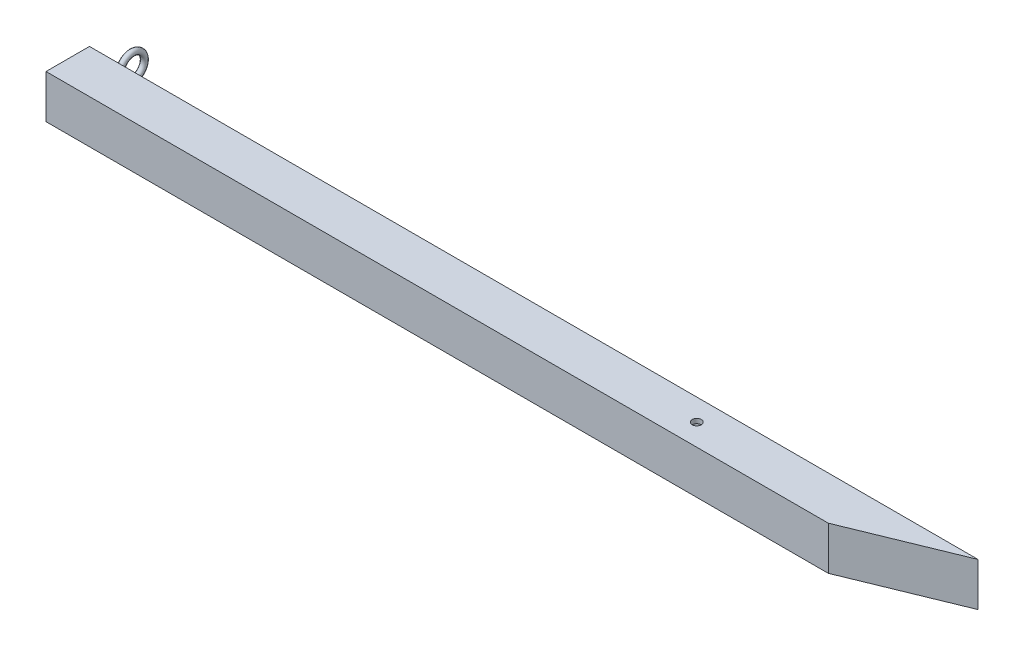
ISO-10303-21;
HEADER;
FILE_DESCRIPTION(('STEP AP214'),'2;1');
FILE_NAME('part.step','',(''),(''),'','','');
FILE_SCHEMA(('AUTOMOTIVE_DESIGN { 1 0 10303 214 1 1 1 1 }'));
ENDSEC;
DATA;
#1=APPLICATION_CONTEXT('core data for automotive mechanical design processes');
#2=APPLICATION_PROTOCOL_DEFINITION('international standard','automotive_design',2000,#1);
#3=PRODUCT_CONTEXT('',#1,'mechanical');
#4=PRODUCT('Part','Part','',(#3));
#5=PRODUCT_RELATED_PRODUCT_CATEGORY('part','',(#4));
#6=PRODUCT_DEFINITION_FORMATION('','',#4);
#7=PRODUCT_DEFINITION_CONTEXT('part definition',#1,'design');
#8=PRODUCT_DEFINITION('design','',#6,#7);
#9=PRODUCT_DEFINITION_SHAPE('','',#8);
#10=(LENGTH_UNIT() NAMED_UNIT(*) SI_UNIT(.MILLI.,.METRE.));
#11=(NAMED_UNIT(*) PLANE_ANGLE_UNIT() SI_UNIT($,.RADIAN.));
#12=(NAMED_UNIT(*) SI_UNIT($,.STERADIAN.) SOLID_ANGLE_UNIT());
#13=UNCERTAINTY_MEASURE_WITH_UNIT(LENGTH_MEASURE(1.E-05),#10,'distance_accuracy_value','');
#14=(GEOMETRIC_REPRESENTATION_CONTEXT(3) GLOBAL_UNCERTAINTY_ASSIGNED_CONTEXT((#13)) GLOBAL_UNIT_ASSIGNED_CONTEXT((#10,
#11,#12)) REPRESENTATION_CONTEXT('',''));
#15=CARTESIAN_POINT('',(0.,0.,0.));
#16=DIRECTION('',(0.,0.,1.));
#17=DIRECTION('',(1.,0.,0.));
#18=AXIS2_PLACEMENT_3D('',#15,#16,#17);
#19=CARTESIAN_POINT('',(0.,19.,19.));
#20=DIRECTION('',(0.,0.,-1.));
#21=DIRECTION('',(0.,1.,0.));
#22=AXIS2_PLACEMENT_3D('',#19,#20,#21);
#23=PLANE('',#22);
#24=DIRECTION('',(0.,-1.,0.));
#25=VECTOR('',#24,1.);
#26=CARTESIAN_POINT('',(-762.63683242,19.,19.));
#27=LINE('',#26,#25);
#28=CARTESIAN_POINT('',(-762.63683242,19.,19.));
#29=VERTEX_POINT('',#28);
#30=CARTESIAN_POINT('',(-762.63683242,-19.,19.));
#31=VERTEX_POINT('',#30);
#32=EDGE_CURVE('E213',#29,#31,#27,.T.);
#33=ORIENTED_EDGE('',*,*,#32,.T.);
#34=DIRECTION('',(-1.,0.,0.));
#35=VECTOR('',#34,1.);
#36=CARTESIAN_POINT('',(0.,-19.,19.));
#37=LINE('',#36,#35);
#38=CARTESIAN_POINT('',(-78.672157524254,-19.,19.));
#39=VERTEX_POINT('',#38);
#40=EDGE_CURVE('E217',#39,#31,#37,.T.);
#41=ORIENTED_EDGE('',*,*,#40,.F.);
#42=DIRECTION('',(0.,1.,0.));
#43=VECTOR('',#42,1.);
#44=CARTESIAN_POINT('',(-78.672157524254,-19.,19.));
#45=LINE('',#44,#43);
#46=CARTESIAN_POINT('',(-78.672157524254,19.,19.));
#47=VERTEX_POINT('',#46);
#48=EDGE_CURVE('E157',#39,#47,#45,.T.);
#49=ORIENTED_EDGE('',*,*,#48,.T.);
#50=DIRECTION('',(-1.,0.,0.));
#51=VECTOR('',#50,1.);
#52=CARTESIAN_POINT('',(0.,19.,19.));
#53=LINE('',#52,#51);
#54=EDGE_CURVE('E196',#47,#29,#53,.T.);
#55=ORIENTED_EDGE('',*,*,#54,.T.);
#56=EDGE_LOOP('',(#33,#41,#49,#55));
#57=FACE_BOUND('',#56,.T.);
#58=ADVANCED_FACE('F58',(#57),#23,.F.);
#59=CARTESIAN_POINT('',(0.,-19.,-19.));
#60=DIRECTION('',(0.,1.,0.));
#61=DIRECTION('',(0.,0.,1.));
#62=AXIS2_PLACEMENT_3D('',#59,#60,#61);
#63=PLANE('',#62);
#64=CARTESIAN_POINT('',(-212.63683242,-19.,0.));
#65=DIRECTION('',(0.,1.,0.));
#66=DIRECTION('',(0.,0.,1.));
#67=AXIS2_PLACEMENT_3D('',#64,#65,#66);
#68=CIRCLE('',#67,3.99999999999999);
#69=CARTESIAN_POINT('',(-212.63683242,-19.,4.00000000000002));
#70=VERTEX_POINT('',#69);
#71=EDGE_CURVE('E180',#70,#70,#68,.T.);
#72=ORIENTED_EDGE('',*,*,#71,.T.);
#73=EDGE_LOOP('',(#72));
#74=FACE_BOUND('',#73,.T.);
#75=DIRECTION('',(0.,0.,-1.));
#76=VECTOR('',#75,1.);
#77=CARTESIAN_POINT('',(-762.63683242,-19.,-19.));
#78=LINE('',#77,#76);
#79=CARTESIAN_POINT('',(-762.63683242,-19.,-19.));
#80=VERTEX_POINT('',#79);
#81=EDGE_CURVE('E220',#31,#80,#78,.T.);
#82=ORIENTED_EDGE('',*,*,#81,.T.);
#83=DIRECTION('',(-1.,0.,0.));
#84=VECTOR('',#83,1.);
#85=CARTESIAN_POINT('',(0.,-19.,-19.));
#86=LINE('',#85,#84);
#87=CARTESIAN_POINT('',(14.258492684254,-19.,-19.));
#88=VERTEX_POINT('',#87);
#89=EDGE_CURVE('E226',#88,#80,#86,.T.);
#90=ORIENTED_EDGE('',*,*,#89,.F.);
#91=DIRECTION('',(-0.925606576571254,0.,0.378487074294542));
#92=VECTOR('',#91,1.);
#93=CARTESIAN_POINT('',(-78.672157524254,-19.,19.));
#94=LINE('',#93,#92);
#95=EDGE_CURVE('E150',#88,#39,#94,.T.);
#96=ORIENTED_EDGE('',*,*,#95,.T.);
#97=ORIENTED_EDGE('',*,*,#40,.T.);
#98=EDGE_LOOP('',(#82,#90,#96,#97));
#99=FACE_BOUND('',#98,.T.);
#100=ADVANCED_FACE('F256',(#74,#99),#63,.F.);
#101=CARTESIAN_POINT('',(0.,19.,-19.));
#102=DIRECTION('',(0.,0.,1.));
#103=DIRECTION('',(0.,-1.,0.));
#104=AXIS2_PLACEMENT_3D('',#101,#102,#103);
#105=PLANE('',#104);
#106=CARTESIAN_POINT('',(-747.63683242,0.,-19.));
#107=DIRECTION('',(0.,0.,1.));
#108=DIRECTION('',(0.,-1.,0.));
#109=AXIS2_PLACEMENT_3D('',#106,#107,#108);
#110=CIRCLE('',#109,2.49999999999995);
#111=CARTESIAN_POINT('',(-747.63683242,-2.49999999999996,-19.));
#112=VERTEX_POINT('',#111);
#113=EDGE_CURVE('E161',#112,#112,#110,.T.);
#114=ORIENTED_EDGE('',*,*,#113,.T.);
#115=EDGE_LOOP('',(#114));
#116=FACE_BOUND('',#115,.T.);
#117=DIRECTION('',(0.,1.,0.));
#118=VECTOR('',#117,1.);
#119=CARTESIAN_POINT('',(-762.63683242,19.,-19.));
#120=LINE('',#119,#118);
#121=CARTESIAN_POINT('',(-762.63683242,19.,-19.));
#122=VERTEX_POINT('',#121);
#123=EDGE_CURVE('E229',#80,#122,#120,.T.);
#124=ORIENTED_EDGE('',*,*,#123,.T.);
#125=DIRECTION('',(-1.,0.,0.));
#126=VECTOR('',#125,1.);
#127=CARTESIAN_POINT('',(0.,19.,-19.));
#128=LINE('',#127,#126);
#129=CARTESIAN_POINT('',(14.258492684254,19.,-19.));
#130=VERTEX_POINT('',#129);
#131=EDGE_CURVE('E233',#130,#122,#128,.T.);
#132=ORIENTED_EDGE('',*,*,#131,.F.);
#133=DIRECTION('',(0.,1.,0.));
#134=VECTOR('',#133,1.);
#135=CARTESIAN_POINT('',(14.258492684254,-19.,-19.));
#136=LINE('',#135,#134);
#137=EDGE_CURVE('E154',#88,#130,#136,.T.);
#138=ORIENTED_EDGE('',*,*,#137,.F.);
#139=ORIENTED_EDGE('',*,*,#89,.T.);
#140=EDGE_LOOP('',(#124,#132,#138,#139));
#141=FACE_BOUND('',#140,.T.);
#142=ADVANCED_FACE('F263',(#116,#141),#105,.F.);
#143=CARTESIAN_POINT('',(0.,19.,-19.));
#144=DIRECTION('',(0.,-1.,0.));
#145=DIRECTION('',(0.,0.,-1.));
#146=AXIS2_PLACEMENT_3D('',#143,#144,#145);
#147=PLANE('',#146);
#148=CARTESIAN_POINT('',(-212.63683242,19.,0.));
#149=DIRECTION('',(0.,1.,0.));
#150=DIRECTION('',(0.,0.,1.));
#151=AXIS2_PLACEMENT_3D('',#148,#149,#150);
#152=CIRCLE('',#151,3.99999999999999);
#153=CARTESIAN_POINT('',(-212.63683242,19.,4.00000000000002));
#154=VERTEX_POINT('',#153);
#155=EDGE_CURVE('E179',#154,#154,#152,.T.);
#156=ORIENTED_EDGE('',*,*,#155,.F.);
#157=EDGE_LOOP('',(#156));
#158=FACE_BOUND('',#157,.T.);
#159=DIRECTION('',(0.,0.,1.));
#160=VECTOR('',#159,1.);
#161=CARTESIAN_POINT('',(-762.63683242,19.,-19.));
#162=LINE('',#161,#160);
#163=EDGE_CURVE('E67',#122,#29,#162,.T.);
#164=ORIENTED_EDGE('',*,*,#163,.T.);
#165=ORIENTED_EDGE('',*,*,#54,.F.);
#166=DIRECTION('',(-0.925606576571254,0.,0.378487074294542));
#167=VECTOR('',#166,1.);
#168=CARTESIAN_POINT('',(-78.672157524254,19.,19.));
#169=LINE('',#168,#167);
#170=EDGE_CURVE('E142',#130,#47,#169,.T.);
#171=ORIENTED_EDGE('',*,*,#170,.F.);
#172=ORIENTED_EDGE('',*,*,#131,.T.);
#173=EDGE_LOOP('',(#164,#165,#171,#172));
#174=FACE_BOUND('',#173,.T.);
#175=ADVANCED_FACE('F269',(#158,#174),#147,.F.);
#176=CARTESIAN_POINT('',(1.,15.,-15.));
#177=DIRECTION('',(0.,-1.,0.));
#178=DIRECTION('',(0.,0.,-1.));
#179=AXIS2_PLACEMENT_3D('',#176,#177,#178);
#180=PLANE('',#179);
#181=DIRECTION('',(0.925606576571255,0.,-0.378487074294542));
#182=VECTOR('',#181,1.);
#183=CARTESIAN_POINT('',(-0.0159570330212459,15.,-17.4845670437519));
#184=LINE('',#183,#182);
#185=CARTESIAN_POINT('',(-79.4583764308563,15.,15.));
#186=VERTEX_POINT('',#185);
#187=CARTESIAN_POINT('',(-6.09207363466578,15.,-15.));
#188=VERTEX_POINT('',#187);
#189=EDGE_CURVE('E136',#186,#188,#184,.T.);
#190=ORIENTED_EDGE('',*,*,#189,.F.);
#191=DIRECTION('',(-1.,0.,0.));
#192=VECTOR('',#191,1.);
#193=CARTESIAN_POINT('',(1.,15.,15.));
#194=LINE('',#193,#192);
#195=CARTESIAN_POINT('',(-762.63683242,15.,15.));
#196=VERTEX_POINT('',#195);
#197=EDGE_CURVE('E124',#186,#196,#194,.T.);
#198=ORIENTED_EDGE('',*,*,#197,.T.);
#199=DIRECTION('',(0.,0.,-1.));
#200=VECTOR('',#199,1.);
#201=CARTESIAN_POINT('',(-762.63683242,15.,-15.));
#202=LINE('',#201,#200);
#203=CARTESIAN_POINT('',(-762.63683242,15.,-15.));
#204=VERTEX_POINT('',#203);
#205=EDGE_CURVE('E201',#196,#204,#202,.T.);
#206=ORIENTED_EDGE('',*,*,#205,.T.);
#207=DIRECTION('',(-1.,0.,0.));
#208=VECTOR('',#207,1.);
#209=CARTESIAN_POINT('',(1.,15.,-15.));
#210=LINE('',#209,#208);
#211=EDGE_CURVE('E139',#188,#204,#210,.T.);
#212=ORIENTED_EDGE('',*,*,#211,.F.);
#213=EDGE_LOOP('',(#190,#198,#206,#212));
#214=FACE_BOUND('',#213,.T.);
#215=CARTESIAN_POINT('',(-212.63683242,15.,0.));
#216=DIRECTION('',(0.,-1.,0.));
#217=DIRECTION('',(0.,0.,-1.));
#218=AXIS2_PLACEMENT_3D('',#215,#216,#217);
#219=CIRCLE('',#218,3.99999999999999);
#220=CARTESIAN_POINT('',(-212.63683242,15.,-3.99999999999996));
#221=VERTEX_POINT('',#220);
#222=EDGE_CURVE('E188',#221,#221,#219,.T.);
#223=ORIENTED_EDGE('',*,*,#222,.F.);
#224=EDGE_LOOP('',(#223));
#225=FACE_BOUND('',#224,.T.);
#226=ADVANCED_FACE('F137',(#214,#225),#180,.T.);
#227=CARTESIAN_POINT('',(1.,15.,-15.));
#228=DIRECTION('',(0.,0.,1.));
#229=DIRECTION('',(1.,0.,0.));
#230=AXIS2_PLACEMENT_3D('',#227,#228,#229);
#231=PLANE('',#230);
#232=DIRECTION('',(0.,-1.,0.));
#233=VECTOR('',#232,1.);
#234=CARTESIAN_POINT('',(-6.09207363466578,15.,-15.));
#235=LINE('',#234,#233);
#236=CARTESIAN_POINT('',(-6.09207363466579,-15.,-15.));
#237=VERTEX_POINT('',#236);
#238=EDGE_CURVE('E74',#188,#237,#235,.T.);
#239=ORIENTED_EDGE('',*,*,#238,.F.);
#240=ORIENTED_EDGE('',*,*,#211,.T.);
#241=DIRECTION('',(0.,-1.,0.));
#242=VECTOR('',#241,1.);
#243=CARTESIAN_POINT('',(-762.63683242,15.,-15.));
#244=LINE('',#243,#242);
#245=CARTESIAN_POINT('',(-762.63683242,-15.,-15.));
#246=VERTEX_POINT('',#245);
#247=EDGE_CURVE('E197',#204,#246,#244,.T.);
#248=ORIENTED_EDGE('',*,*,#247,.T.);
#249=DIRECTION('',(-1.,0.,0.));
#250=VECTOR('',#249,1.);
#251=CARTESIAN_POINT('',(1.,-15.,-15.));
#252=LINE('',#251,#250);
#253=EDGE_CURVE('E208',#237,#246,#252,.T.);
#254=ORIENTED_EDGE('',*,*,#253,.F.);
#255=EDGE_LOOP('',(#239,#240,#248,#254));
#256=FACE_BOUND('',#255,.T.);
#257=ADVANCED_FACE('F247',(#256),#231,.T.);
#258=CARTESIAN_POINT('',(1.,-15.,-15.));
#259=DIRECTION('',(0.,1.,0.));
#260=DIRECTION('',(0.,0.,1.));
#261=AXIS2_PLACEMENT_3D('',#258,#259,#260);
#262=PLANE('',#261);
#263=DIRECTION('',(-0.925606576571255,0.,0.378487074294542));
#264=VECTOR('',#263,1.);
#265=CARTESIAN_POINT('',(-0.0159570330212468,-15.,-17.4845670437519));
#266=LINE('',#265,#264);
#267=CARTESIAN_POINT('',(-79.4583764308563,-15.,15.));
#268=VERTEX_POINT('',#267);
#269=EDGE_CURVE('E82',#237,#268,#266,.T.);
#270=ORIENTED_EDGE('',*,*,#269,.F.);
#271=ORIENTED_EDGE('',*,*,#253,.T.);
#272=DIRECTION('',(0.,0.,1.));
#273=VECTOR('',#272,1.);
#274=CARTESIAN_POINT('',(-762.63683242,-15.,-15.));
#275=LINE('',#274,#273);
#276=CARTESIAN_POINT('',(-762.63683242,-15.,15.));
#277=VERTEX_POINT('',#276);
#278=EDGE_CURVE('E192',#246,#277,#275,.T.);
#279=ORIENTED_EDGE('',*,*,#278,.T.);
#280=DIRECTION('',(-1.,0.,0.));
#281=VECTOR('',#280,1.);
#282=CARTESIAN_POINT('',(1.,-15.,15.));
#283=LINE('',#282,#281);
#284=EDGE_CURVE('E133',#268,#277,#283,.T.);
#285=ORIENTED_EDGE('',*,*,#284,.F.);
#286=EDGE_LOOP('',(#270,#271,#279,#285));
#287=FACE_BOUND('',#286,.T.);
#288=CARTESIAN_POINT('',(-212.63683242,-15.,0.));
#289=DIRECTION('',(0.,1.,0.));
#290=DIRECTION('',(0.,0.,1.));
#291=AXIS2_PLACEMENT_3D('',#288,#289,#290);
#292=CIRCLE('',#291,3.99999999999999);
#293=CARTESIAN_POINT('',(-212.63683242,-15.,4.00000000000002));
#294=VERTEX_POINT('',#293);
#295=EDGE_CURVE('E184',#294,#294,#292,.T.);
#296=ORIENTED_EDGE('',*,*,#295,.F.);
#297=EDGE_LOOP('',(#296));
#298=FACE_BOUND('',#297,.T.);
#299=ADVANCED_FACE('F245',(#287,#298),#262,.T.);
#300=CARTESIAN_POINT('',(1.,15.,15.));
#301=DIRECTION('',(0.,0.,-1.));
#302=DIRECTION('',(-1.,0.,0.));
#303=AXIS2_PLACEMENT_3D('',#300,#301,#302);
#304=PLANE('',#303);
#305=DIRECTION('',(0.,1.,0.));
#306=VECTOR('',#305,1.);
#307=CARTESIAN_POINT('',(-79.4583764308563,15.,15.));
#308=LINE('',#307,#306);
#309=EDGE_CURVE('E12',#268,#186,#308,.T.);
#310=ORIENTED_EDGE('',*,*,#309,.F.);
#311=ORIENTED_EDGE('',*,*,#284,.T.);
#312=DIRECTION('',(0.,1.,0.));
#313=VECTOR('',#312,1.);
#314=CARTESIAN_POINT('',(-762.63683242,15.,15.));
#315=LINE('',#314,#313);
#316=EDGE_CURVE('E128',#277,#196,#315,.T.);
#317=ORIENTED_EDGE('',*,*,#316,.T.);
#318=ORIENTED_EDGE('',*,*,#197,.F.);
#319=EDGE_LOOP('',(#310,#311,#317,#318));
#320=FACE_BOUND('',#319,.T.);
#321=ADVANCED_FACE('F126',(#320),#304,.T.);
#322=CARTESIAN_POINT('',(-762.63683242,0.,0.));
#323=DIRECTION('',(-1.,0.,0.));
#324=DIRECTION('',(0.,0.,1.));
#325=AXIS2_PLACEMENT_3D('',#322,#323,#324);
#326=PLANE('',#325);
#327=ORIENTED_EDGE('',*,*,#32,.F.);
#328=ORIENTED_EDGE('',*,*,#163,.F.);
#329=ORIENTED_EDGE('',*,*,#123,.F.);
#330=ORIENTED_EDGE('',*,*,#81,.F.);
#331=EDGE_LOOP('',(#327,#328,#329,#330));
#332=FACE_BOUND('',#331,.T.);
#333=ORIENTED_EDGE('',*,*,#247,.F.);
#334=ORIENTED_EDGE('',*,*,#205,.F.);
#335=ORIENTED_EDGE('',*,*,#316,.F.);
#336=ORIENTED_EDGE('',*,*,#278,.F.);
#337=EDGE_LOOP('',(#333,#334,#335,#336));
#338=FACE_BOUND('',#337,.T.);
#339=ADVANCED_FACE('F60',(#332,#338),#326,.T.);
#340=CARTESIAN_POINT('',(-212.63683242,-19.,0.));
#341=DIRECTION('',(0.,1.,0.));
#342=DIRECTION('',(0.,0.,1.));
#343=AXIS2_PLACEMENT_3D('',#340,#341,#342);
#344=CYLINDRICAL_SURFACE('',#343,3.99999999999999);
#345=ORIENTED_EDGE('',*,*,#295,.T.);
#346=EDGE_LOOP('',(#345));
#347=FACE_BOUND('',#346,.T.);
#348=ORIENTED_EDGE('',*,*,#71,.F.);
#349=EDGE_LOOP('',(#348));
#350=FACE_BOUND('',#349,.T.);
#351=ADVANCED_FACE('F242',(#347,#350),#344,.F.);
#352=ORIENTED_EDGE('',*,*,#222,.T.);
#353=EDGE_LOOP('',(#352));
#354=FACE_BOUND('',#353,.T.);
#355=ORIENTED_EDGE('',*,*,#155,.T.);
#356=EDGE_LOOP('',(#355));
#357=FACE_BOUND('',#356,.T.);
#358=ADVANCED_FACE('F305',(#354,#357),#344,.F.);
#359=CARTESIAN_POINT('',(-747.63683242,-3.16866893852641,-31.3212637978578));
#360=DIRECTION('',(0.,-0.950063394598164,-0.312056959936186));
#361=DIRECTION('',(0.,0.312056959936186,-0.950063394598164));
#362=AXIS2_PLACEMENT_3D('',#359,#360,#361);
#363=PLANE('',#362);
#364=CARTESIAN_POINT('',(-747.63683242,-3.16866893852641,-31.3212637978578));
#365=DIRECTION('',(0.,-0.950063394598164,-0.312056959936186));
#366=DIRECTION('',(0.,0.312056959936186,-0.950063394598164));
#367=AXIS2_PLACEMENT_3D('',#364,#365,#366);
#368=CIRCLE('',#367,2.49999999999995);
#369=CARTESIAN_POINT('',(-747.63683242,-2.38852653868596,-33.6964222843532));
#370=VERTEX_POINT('',#369);
#371=EDGE_CURVE('E175',#370,#370,#368,.T.);
#372=ORIENTED_EDGE('',*,*,#371,.F.);
#373=EDGE_LOOP('',(#372));
#374=FACE_BOUND('',#373,.T.);
#375=ADVANCED_FACE('F297',(#374),#363,.F.);
#376=CARTESIAN_POINT('',(-747.63683242,0.,-19.));
#377=DIRECTION('',(0.,0.,-1.));
#378=DIRECTION('',(0.,1.,0.));
#379=AXIS2_PLACEMENT_3D('',#376,#377,#378);
#380=CYLINDRICAL_SURFACE('',#379,2.49999999999995);
#381=CARTESIAN_POINT('',(-747.63683242,0.,-26.570946824867));
#382=DIRECTION('',(0.,0.,1.));
#383=DIRECTION('',(0.,-1.,0.));
#384=AXIS2_PLACEMENT_3D('',#381,#382,#383);
#385=CIRCLE('',#384,2.49999999999995);
#386=CARTESIAN_POINT('',(-747.63683242,-2.49999999999995,-26.570946824867));
#387=VERTEX_POINT('',#386);
#388=EDGE_CURVE('E167',#387,#387,#385,.T.);
#389=ORIENTED_EDGE('',*,*,#388,.T.);
#390=EDGE_LOOP('',(#389));
#391=FACE_BOUND('',#390,.T.);
#392=ORIENTED_EDGE('',*,*,#113,.F.);
#393=EDGE_LOOP('',(#392));
#394=FACE_BOUND('',#393,.T.);
#395=ADVANCED_FACE('F308',(#391,#394),#380,.T.);
#396=CARTESIAN_POINT('',(-747.63683242,5.,-26.570946824867));
#397=DIRECTION('',(1.,0.,0.));
#398=DIRECTION('',(0.,0.,-1.));
#399=AXIS2_PLACEMENT_3D('',#396,#397,#398);
#400=TOROIDAL_SURFACE('',#399,5.,2.49999999999995);
#401=CARTESIAN_POINT('',(-747.63683242,3.43971520031906,-31.3212637978578));
#402=DIRECTION('',(0.,-0.950063394598164,0.312056959936186));
#403=DIRECTION('',(0.,-0.312056959936186,-0.950063394598164));
#404=AXIS2_PLACEMENT_3D('',#401,#402,#403);
#405=CIRCLE('',#404,2.49999999999995);
#406=CARTESIAN_POINT('',(-747.63683242,2.65957280047861,-33.6964222843532));
#407=VERTEX_POINT('',#406);
#408=EDGE_CURVE('E171',#407,#407,#405,.T.);
#409=CARTESIAN_POINT('',(-747.63683242,5.,-26.570946824867));
#410=DIRECTION('',(1.,0.,0.));
#411=DIRECTION('',(0.,0.,-1.));
#412=AXIS2_PLACEMENT_3D('',#409,#410,#411);
#413=CIRCLE('',#412,7.49999999999995);
#414=EDGE_CURVE('',#387,#407,#413,.T.);
#415=ORIENTED_EDGE('',*,*,#388,.F.);
#416=ORIENTED_EDGE('',*,*,#408,.T.);
#417=ORIENTED_EDGE('',*,*,#414,.T.);
#418=ORIENTED_EDGE('',*,*,#414,.F.);
#419=EDGE_LOOP('',(#415,#417,#416,#418));
#420=FACE_BOUND('',#419,.T.);
#421=ADVANCED_FACE('F302',(#420),#400,.T.);
#422=CARTESIAN_POINT('',(-747.63683242,0.13552313089633,-41.3809398727707));
#423=DIRECTION('',(-1.,0.,0.));
#424=DIRECTION('',(0.,0.,1.));
#425=AXIS2_PLACEMENT_3D('',#422,#423,#424);
#426=TOROIDAL_SURFACE('',#425,10.588426132519,2.49999999999995);
#427=ORIENTED_EDGE('',*,*,#371,.T.);
#428=EDGE_LOOP('',(#427));
#429=FACE_BOUND('',#428,.T.);
#430=ORIENTED_EDGE('',*,*,#408,.F.);
#431=EDGE_LOOP('',(#430));
#432=FACE_BOUND('',#431,.T.);
#433=ADVANCED_FACE('F295',(#429,#432),#426,.T.);
#434=CARTESIAN_POINT('',(-78.672157524254,-19.,19.));
#435=DIRECTION('',(-0.378487074294542,0.,-0.925606576571254));
#436=DIRECTION('',(-0.925606576571255,0.,0.378487074294542));
#437=AXIS2_PLACEMENT_3D('',#434,#435,#436);
#438=PLANE('',#437);
#439=ORIENTED_EDGE('',*,*,#170,.T.);
#440=ORIENTED_EDGE('',*,*,#48,.F.);
#441=ORIENTED_EDGE('',*,*,#95,.F.);
#442=ORIENTED_EDGE('',*,*,#137,.T.);
#443=EDGE_LOOP('',(#439,#440,#441,#442));
#444=FACE_BOUND('',#443,.T.);
#445=ADVANCED_FACE('F289',(#444),#438,.F.);
#446=CARTESIAN_POINT('',(3.6901000714929,-19.,-19.));
#447=DIRECTION('',(-0.378487074294542,0.,-0.925606576571255));
#448=DIRECTION('',(-0.925606576571255,0.,0.378487074294542));
#449=AXIS2_PLACEMENT_3D('',#446,#447,#448);
#450=PLANE('',#449);
#451=ORIENTED_EDGE('',*,*,#309,.T.);
#452=ORIENTED_EDGE('',*,*,#189,.T.);
#453=ORIENTED_EDGE('',*,*,#238,.T.);
#454=ORIENTED_EDGE('',*,*,#269,.T.);
#455=EDGE_LOOP('',(#451,#452,#453,#454));
#456=FACE_BOUND('',#455,.T.);
#457=ADVANCED_FACE('F144',(#456),#450,.T.);
#458=CLOSED_SHELL('',(#58,#100,#142,#175,#226,#257,#299,#321,#339,#351,#358,#375,#395,#421,#433,
#445,#457));
#459=MANIFOLD_SOLID_BREP('B2',#458);
#460=ADVANCED_BREP_SHAPE_REPRESENTATION('',(#18,#459),#14);
#461=SHAPE_DEFINITION_REPRESENTATION(#9,#460);
ENDSEC;
END-ISO-10303-21;
